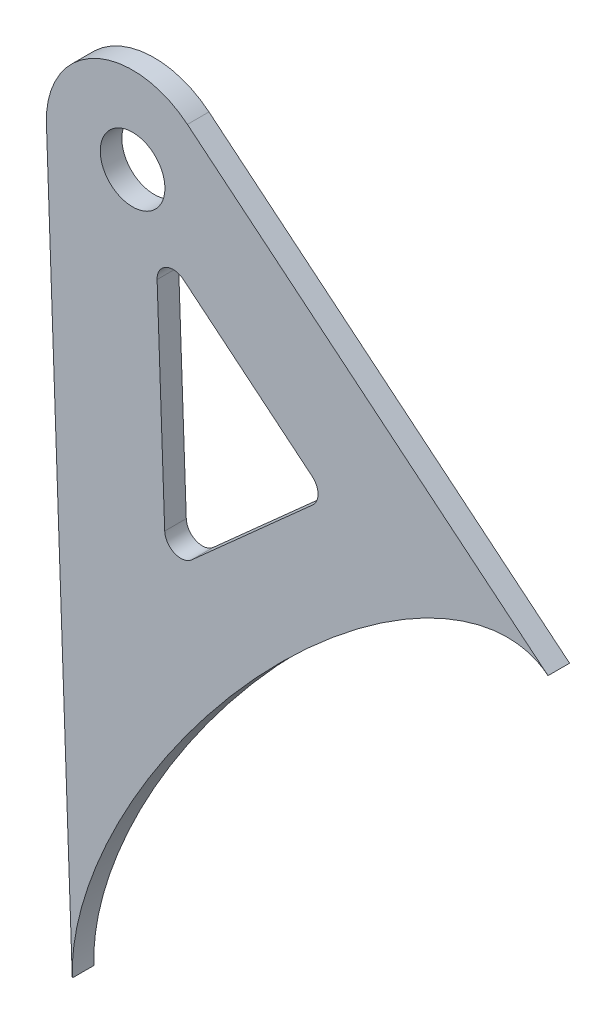
ISO-10303-21;
HEADER;
FILE_DESCRIPTION(('STEP AP214'),'2;1');
FILE_NAME('part.step','',(''),(''),'','','');
FILE_SCHEMA(('AUTOMOTIVE_DESIGN { 1 0 10303 214 1 1 1 1 }'));
ENDSEC;
DATA;
#1=APPLICATION_CONTEXT('core data for automotive mechanical design processes');
#2=APPLICATION_PROTOCOL_DEFINITION('international standard','automotive_design',2000,#1);
#3=PRODUCT_CONTEXT('',#1,'mechanical');
#4=PRODUCT('Part','Part','',(#3));
#5=PRODUCT_RELATED_PRODUCT_CATEGORY('part','',(#4));
#6=PRODUCT_DEFINITION_FORMATION('','',#4);
#7=PRODUCT_DEFINITION_CONTEXT('part definition',#1,'design');
#8=PRODUCT_DEFINITION('design','',#6,#7);
#9=PRODUCT_DEFINITION_SHAPE('','',#8);
#10=(LENGTH_UNIT() NAMED_UNIT(*) SI_UNIT(.MILLI.,.METRE.));
#11=(NAMED_UNIT(*) PLANE_ANGLE_UNIT() SI_UNIT($,.RADIAN.));
#12=(NAMED_UNIT(*) SI_UNIT($,.STERADIAN.) SOLID_ANGLE_UNIT());
#13=UNCERTAINTY_MEASURE_WITH_UNIT(LENGTH_MEASURE(1.E-05),#10,'distance_accuracy_value','');
#14=(GEOMETRIC_REPRESENTATION_CONTEXT(3) GLOBAL_UNCERTAINTY_ASSIGNED_CONTEXT((#13)) GLOBAL_UNIT_ASSIGNED_CONTEXT((#10,
#11,#12)) REPRESENTATION_CONTEXT('',''));
#15=CARTESIAN_POINT('',(0.,0.,0.));
#16=DIRECTION('',(0.,0.,1.));
#17=DIRECTION('',(1.,0.,0.));
#18=AXIS2_PLACEMENT_3D('',#15,#16,#17);
#19=CARTESIAN_POINT('',(1375.39150654888,-231.129570023266,-434.28));
#20=DIRECTION('',(0.,0.,-1.));
#21=DIRECTION('',(0.,-1.,0.));
#22=AXIS2_PLACEMENT_3D('',#19,#20,#21);
#23=PLANE('',#22);
#24=DIRECTION('',(0.035527138054527,-0.999368711968538,0.));
#25=VECTOR('',#24,1.);
#26=CARTESIAN_POINT('',(1352.00505030431,-200.284217104434,-434.28));
#27=LINE('',#26,#25);
#28=CARTESIAN_POINT('',(1352.00505030431,-200.284217104434,-434.28));
#29=VERTEX_POINT('',#28);
#30=CARTESIAN_POINT('',(1354.40386942977,-267.762345400856,-434.28));
#31=VERTEX_POINT('',#30);
#32=EDGE_CURVE('E193',#29,#31,#27,.T.);
#33=ORIENTED_EDGE('',*,*,#32,.F.);
#34=CARTESIAN_POINT('',(1360.,-200.,-434.28));
#35=DIRECTION('',(0.,0.,1.));
#36=DIRECTION('',(1.,0.,0.));
#37=AXIS2_PLACEMENT_3D('',#34,#35,#36);
#38=CIRCLE('',#37,7.99999999993676);
#39=CARTESIAN_POINT('',(1365.08691241126,-193.825591354697,-434.28));
#40=VERTEX_POINT('',#39);
#41=EDGE_CURVE('E169',#40,#29,#38,.T.);
#42=ORIENTED_EDGE('',*,*,#41,.F.);
#43=DIRECTION('',(0.771801080668979,-0.635864051412089,0.));
#44=VECTOR('',#43,1.);
#45=CARTESIAN_POINT('',(1365.08691241126,-193.825591354697,-434.28));
#46=LINE('',#45,#44);
#47=CARTESIAN_POINT('',(1398.54852053125,-221.393619229834,-434.28));
#48=VERTEX_POINT('',#47);
#49=EDGE_CURVE('E174',#40,#48,#46,.T.);
#50=ORIENTED_EDGE('',*,*,#49,.T.);
#51=CARTESIAN_POINT('',(1354.40386942977,-267.762345400856,-434.28));
#52=CARTESIAN_POINT('',(1353.43245275836,-240.436659155121,-434.28));
#53=CARTESIAN_POINT('',(1386.53706756762,-211.615049683143,-434.28));
#54=CARTESIAN_POINT('',(1398.52725809821,-221.376205911584,-434.28));
#55=CARTESIAN_POINT('',(1398.53435990197,-221.381987455749,-434.28));
#56=CARTESIAN_POINT('',(1398.54144739585,-221.387791883071,-434.28));
#57=CARTESIAN_POINT('',(1398.54852053125,-221.393619229834,-434.28));
#58=(BOUNDED_CURVE() B_SPLINE_CURVE(3,(#51,#52,#53,#54,#55,#56,#57),.UNSPECIFIED.,.F.,
.F.) B_SPLINE_CURVE_WITH_KNOTS((4,3,4),(0.0852875382307011,0.5,0.500549054517509),
.UNSPECIFIED.) CURVE() GEOMETRIC_REPRESENTATION_ITEM() RATIONAL_B_SPLINE_CURVE((0.717041560496822,
0.352730571139875,0.447050050974268,1.,0.999267927309988,0.998536658515611,0.99780619361687)) REPRESENTATION_ITEM(''));
#59=EDGE_CURVE('E201',#31,#48,#58,.T.);
#60=ORIENTED_EDGE('',*,*,#59,.F.);
#61=EDGE_LOOP('',(#33,#42,#50,#60));
#62=FACE_BOUND('',#61,.T.);
#63=CARTESIAN_POINT('',(1364.47997732206,-227.50430289175,-434.28));
#64=DIRECTION('',(0.,0.,1.));
#65=DIRECTION('',(1.,0.,0.));
#66=AXIS2_PLACEMENT_3D('',#63,#64,#65);
#67=CIRCLE('',#66,1.49999999999995);
#68=CARTESIAN_POINT('',(1365.47901822837,-228.623193980065,-434.28));
#69=VERTEX_POINT('',#68);
#70=CARTESIAN_POINT('',(1362.9809242541,-227.557593598832,-434.28));
#71=VERTEX_POINT('',#70);
#72=EDGE_CURVE('E119',#69,#71,#67,.F.);
#73=ORIENTED_EDGE('',*,*,#72,.F.);
#74=DIRECTION('',(-0.745927392210289,-0.666027270875869,0.));
#75=VECTOR('',#74,1.);
#76=CARTESIAN_POINT('',(719.297841581458,-805.588579710492,-434.28));
#77=LINE('',#76,#75);
#78=CARTESIAN_POINT('',(1376.70865342178,-218.596422797098,-434.28));
#79=VERTEX_POINT('',#78);
#80=EDGE_CURVE('E128',#79,#69,#77,.T.);
#81=ORIENTED_EDGE('',*,*,#80,.F.);
#82=CARTESIAN_POINT('',(1375.70961251547,-217.477531708782,-434.28));
#83=DIRECTION('',(0.,0.,1.));
#84=DIRECTION('',(1.,0.,0.));
#85=AXIS2_PLACEMENT_3D('',#82,#83,#84);
#86=CIRCLE('',#85,1.50000000000003);
#87=CARTESIAN_POINT('',(1376.66340859259,-216.319830087778,-434.28));
#88=VERTEX_POINT('',#87);
#89=EDGE_CURVE('E133',#79,#88,#86,.T.);
#90=ORIENTED_EDGE('',*,*,#89,.T.);
#91=DIRECTION('',(0.771801080668963,-0.635864051412109,0.));
#92=VECTOR('',#91,1.);
#93=CARTESIAN_POINT('',(450.455564443834,546.755380586496,-434.28));
#94=LINE('',#93,#92);
#95=CARTESIAN_POINT('',(1364.72775142934,-206.486395657352,-434.28));
#96=VERTEX_POINT('',#95);
#97=EDGE_CURVE('E155',#96,#88,#94,.T.);
#98=ORIENTED_EDGE('',*,*,#97,.F.);
#99=CARTESIAN_POINT('',(1363.77395535222,-207.644097278355,-434.28));
#100=DIRECTION('',(0.,0.,1.));
#101=DIRECTION('',(1.,0.,0.));
#102=AXIS2_PLACEMENT_3D('',#99,#100,#101);
#103=CIRCLE('',#102,1.50000000000002);
#104=CARTESIAN_POINT('',(1362.27490228427,-207.697387985437,-434.28));
#105=VERTEX_POINT('',#104);
#106=EDGE_CURVE('E158',#96,#105,#103,.T.);
#107=ORIENTED_EDGE('',*,*,#106,.T.);
#108=DIRECTION('',(0.0355271380545357,-0.999368711968538,0.));
#109=VECTOR('',#108,1.);
#110=CARTESIAN_POINT('',(1353.18123393235,48.1050246370281,-434.28));
#111=LINE('',#110,#109);
#112=EDGE_CURVE('E138',#105,#71,#111,.T.);
#113=ORIENTED_EDGE('',*,*,#112,.T.);
#114=EDGE_LOOP('',(#73,#81,#90,#98,#107,#113));
#115=FACE_BOUND('',#114,.T.);
#116=CARTESIAN_POINT('',(1360.,-200.,-434.28));
#117=DIRECTION('',(0.,0.,1.));
#118=DIRECTION('',(1.,0.,0.));
#119=AXIS2_PLACEMENT_3D('',#116,#117,#118);
#120=CIRCLE('',#119,2.99999999999993);
#121=CARTESIAN_POINT('',(1363.,-200.,-434.28));
#122=VERTEX_POINT('',#121);
#123=EDGE_CURVE('E267',#122,#122,#120,.T.);
#124=ORIENTED_EDGE('',*,*,#123,.T.);
#125=EDGE_LOOP('',(#124));
#126=FACE_BOUND('',#125,.T.);
#127=ADVANCED_FACE('F40',(#62,#115,#126),#23,.T.);
#128=CARTESIAN_POINT('',(1375.39150654888,-231.129570023266,-432.28));
#129=DIRECTION('',(0.,0.,-1.));
#130=DIRECTION('',(0.,-1.,0.));
#131=AXIS2_PLACEMENT_3D('',#128,#129,#130);
#132=PLANE('',#131);
#133=DIRECTION('',(0.0355271380545357,-0.999368711968538,0.));
#134=VECTOR('',#133,1.);
#135=CARTESIAN_POINT('',(1353.18123393235,48.1050246370281,-432.28));
#136=LINE('',#135,#134);
#137=CARTESIAN_POINT('',(1362.27490228427,-207.697387985437,-432.28));
#138=VERTEX_POINT('',#137);
#139=CARTESIAN_POINT('',(1362.9809242541,-227.557593598832,-432.28));
#140=VERTEX_POINT('',#139);
#141=EDGE_CURVE('E139',#138,#140,#136,.T.);
#142=ORIENTED_EDGE('',*,*,#141,.F.);
#143=CARTESIAN_POINT('',(1363.77395535222,-207.644097278355,-432.28));
#144=DIRECTION('',(0.,0.,1.));
#145=DIRECTION('',(1.,0.,0.));
#146=AXIS2_PLACEMENT_3D('',#143,#144,#145);
#147=CIRCLE('',#146,1.50000000000002);
#148=CARTESIAN_POINT('',(1364.72775142934,-206.486395657352,-432.28));
#149=VERTEX_POINT('',#148);
#150=EDGE_CURVE('E142',#149,#138,#147,.T.);
#151=ORIENTED_EDGE('',*,*,#150,.F.);
#152=DIRECTION('',(0.771801080668963,-0.635864051412109,0.));
#153=VECTOR('',#152,1.);
#154=CARTESIAN_POINT('',(450.455564443834,546.755380586496,-432.28));
#155=LINE('',#154,#153);
#156=CARTESIAN_POINT('',(1376.66340859259,-216.319830087778,-432.28));
#157=VERTEX_POINT('',#156);
#158=EDGE_CURVE('E276',#149,#157,#155,.T.);
#159=ORIENTED_EDGE('',*,*,#158,.T.);
#160=CARTESIAN_POINT('',(1375.70961251547,-217.477531708782,-432.28));
#161=DIRECTION('',(0.,0.,1.));
#162=DIRECTION('',(1.,0.,0.));
#163=AXIS2_PLACEMENT_3D('',#160,#161,#162);
#164=CIRCLE('',#163,1.50000000000003);
#165=CARTESIAN_POINT('',(1376.70865342178,-218.596422797098,-432.28));
#166=VERTEX_POINT('',#165);
#167=EDGE_CURVE('E273',#166,#157,#164,.T.);
#168=ORIENTED_EDGE('',*,*,#167,.F.);
#169=DIRECTION('',(-0.745927392210289,-0.666027270875869,0.));
#170=VECTOR('',#169,1.);
#171=CARTESIAN_POINT('',(719.297841581458,-805.588579710492,-432.28));
#172=LINE('',#171,#170);
#173=CARTESIAN_POINT('',(1365.47901822837,-228.623193980065,-432.28));
#174=VERTEX_POINT('',#173);
#175=EDGE_CURVE('E270',#166,#174,#172,.T.);
#176=ORIENTED_EDGE('',*,*,#175,.T.);
#177=CARTESIAN_POINT('',(1364.47997732206,-227.50430289175,-432.28));
#178=DIRECTION('',(0.,0.,1.));
#179=DIRECTION('',(1.,0.,0.));
#180=AXIS2_PLACEMENT_3D('',#177,#178,#179);
#181=CIRCLE('',#180,1.49999999999995);
#182=EDGE_CURVE('E120',#174,#140,#181,.F.);
#183=ORIENTED_EDGE('',*,*,#182,.T.);
#184=EDGE_LOOP('',(#142,#151,#159,#168,#176,#183));
#185=FACE_BOUND('',#184,.T.);
#186=DIRECTION('',(0.035527138054527,-0.999368711968538,0.));
#187=VECTOR('',#186,1.);
#188=CARTESIAN_POINT('',(1352.00505030431,-200.284217104434,-432.28));
#189=LINE('',#188,#187);
#190=CARTESIAN_POINT('',(1352.00505030431,-200.284217104434,-432.28));
#191=VERTEX_POINT('',#190);
#192=CARTESIAN_POINT('',(1354.40386942977,-267.762345400856,-432.28));
#193=VERTEX_POINT('',#192);
#194=EDGE_CURVE('E124',#191,#193,#189,.T.);
#195=ORIENTED_EDGE('',*,*,#194,.T.);
#196=CARTESIAN_POINT('',(1354.40386942977,-267.762345400856,-432.28));
#197=CARTESIAN_POINT('',(1353.43245275836,-240.436659155121,-432.28));
#198=CARTESIAN_POINT('',(1386.53706756762,-211.615049683143,-432.28));
#199=CARTESIAN_POINT('',(1398.52725809821,-221.376205911584,-432.28));
#200=CARTESIAN_POINT('',(1398.53435990197,-221.381987455749,-432.28));
#201=CARTESIAN_POINT('',(1398.54144739585,-221.387791883071,-432.28));
#202=CARTESIAN_POINT('',(1398.54852053125,-221.393619229834,-432.28));
#203=(BOUNDED_CURVE() B_SPLINE_CURVE(3,(#196,#197,#198,#199,#200,#201,#202),.UNSPECIFIED.,.F.,
.F.) B_SPLINE_CURVE_WITH_KNOTS((4,3,4),(0.0852875382307011,0.5,0.500549054517509),
.UNSPECIFIED.) CURVE() GEOMETRIC_REPRESENTATION_ITEM() RATIONAL_B_SPLINE_CURVE((0.717041560496822,
0.352730571139875,0.447050050974268,1.,0.999267927309988,0.998536658515611,0.99780619361687)) REPRESENTATION_ITEM(''));
#204=CARTESIAN_POINT('',(1398.54852053125,-221.393619229834,-432.28));
#205=VERTEX_POINT('',#204);
#206=EDGE_CURVE('E179',#193,#205,#203,.T.);
#207=ORIENTED_EDGE('',*,*,#206,.T.);
#208=DIRECTION('',(0.771801080668979,-0.635864051412089,0.));
#209=VECTOR('',#208,1.);
#210=CARTESIAN_POINT('',(1365.08691241126,-193.825591354697,-432.28));
#211=LINE('',#210,#209);
#212=CARTESIAN_POINT('',(1365.08691241126,-193.825591354697,-432.28));
#213=VERTEX_POINT('',#212);
#214=EDGE_CURVE('E184',#213,#205,#211,.T.);
#215=ORIENTED_EDGE('',*,*,#214,.F.);
#216=CARTESIAN_POINT('',(1360.,-200.,-432.28));
#217=DIRECTION('',(0.,0.,1.));
#218=DIRECTION('',(1.,0.,0.));
#219=AXIS2_PLACEMENT_3D('',#216,#217,#218);
#220=CIRCLE('',#219,7.99999999993676);
#221=EDGE_CURVE('E190',#213,#191,#220,.T.);
#222=ORIENTED_EDGE('',*,*,#221,.T.);
#223=EDGE_LOOP('',(#195,#207,#215,#222));
#224=FACE_BOUND('',#223,.T.);
#225=CARTESIAN_POINT('',(1360.,-200.,-432.28));
#226=DIRECTION('',(0.,0.,1.));
#227=DIRECTION('',(1.,0.,0.));
#228=AXIS2_PLACEMENT_3D('',#225,#226,#227);
#229=CIRCLE('',#228,2.99999999999993);
#230=CARTESIAN_POINT('',(1363.,-200.,-432.28));
#231=VERTEX_POINT('',#230);
#232=EDGE_CURVE('E145',#231,#231,#229,.T.);
#233=ORIENTED_EDGE('',*,*,#232,.F.);
#234=EDGE_LOOP('',(#233));
#235=FACE_BOUND('',#234,.T.);
#236=ADVANCED_FACE('F209',(#185,#224,#235),#132,.F.);
#237=CARTESIAN_POINT('',(1352.00505030431,-200.284217104434,-434.28));
#238=DIRECTION('',(0.999368711968538,0.035527138054527,0.));
#239=DIRECTION('',(-0.035527138054527,0.999368711968538,0.));
#240=AXIS2_PLACEMENT_3D('',#237,#238,#239);
#241=PLANE('',#240);
#242=ORIENTED_EDGE('',*,*,#194,.F.);
#243=DIRECTION('',(0.,0.,1.));
#244=VECTOR('',#243,1.);
#245=CARTESIAN_POINT('',(1352.00505030431,-200.284217104434,-434.28));
#246=LINE('',#245,#244);
#247=EDGE_CURVE('E173',#29,#191,#246,.T.);
#248=ORIENTED_EDGE('',*,*,#247,.F.);
#249=ORIENTED_EDGE('',*,*,#32,.T.);
#250=DIRECTION('',(0.,0.,1.));
#251=VECTOR('',#250,1.);
#252=CARTESIAN_POINT('',(1354.40386942977,-267.762345400856,-434.28));
#253=LINE('',#252,#251);
#254=EDGE_CURVE('E12',#31,#193,#253,.T.);
#255=ORIENTED_EDGE('',*,*,#254,.T.);
#256=EDGE_LOOP('',(#242,#248,#249,#255));
#257=FACE_BOUND('',#256,.T.);
#258=ADVANCED_FACE('F42',(#257),#241,.F.);
#259=DIRECTION('',(0.,0.,1.));
#260=VECTOR('',#259,1.);
#261=SURFACE_OF_LINEAR_EXTRUSION('',#58,#260);
#262=ORIENTED_EDGE('',*,*,#206,.F.);
#263=ORIENTED_EDGE('',*,*,#254,.F.);
#264=ORIENTED_EDGE('',*,*,#59,.T.);
#265=DIRECTION('',(0.,0.,1.));
#266=VECTOR('',#265,1.);
#267=CARTESIAN_POINT('',(1398.54852053125,-221.393619229834,-434.28));
#268=LINE('',#267,#266);
#269=EDGE_CURVE('E48',#48,#205,#268,.T.);
#270=ORIENTED_EDGE('',*,*,#269,.T.);
#271=EDGE_LOOP('',(#262,#263,#264,#270));
#272=FACE_BOUND('',#271,.T.);
#273=ADVANCED_FACE('F199',(#272),#261,.T.);
#274=CARTESIAN_POINT('',(1365.08691241126,-193.825591354697,-434.28));
#275=DIRECTION('',(0.635864051412089,0.771801080668979,0.));
#276=DIRECTION('',(-0.771801080668979,0.635864051412089,0.));
#277=AXIS2_PLACEMENT_3D('',#274,#275,#276);
#278=PLANE('',#277);
#279=ORIENTED_EDGE('',*,*,#214,.T.);
#280=ORIENTED_EDGE('',*,*,#269,.F.);
#281=ORIENTED_EDGE('',*,*,#49,.F.);
#282=DIRECTION('',(0.,0.,1.));
#283=VECTOR('',#282,1.);
#284=CARTESIAN_POINT('',(1365.08691241126,-193.825591354697,-434.28));
#285=LINE('',#284,#283);
#286=EDGE_CURVE('E195',#40,#213,#285,.T.);
#287=ORIENTED_EDGE('',*,*,#286,.T.);
#288=EDGE_LOOP('',(#279,#280,#281,#287));
#289=FACE_BOUND('',#288,.T.);
#290=ADVANCED_FACE('F206',(#289),#278,.T.);
#291=CARTESIAN_POINT('',(1360.,-200.,-434.28));
#292=DIRECTION('',(0.,0.,1.));
#293=DIRECTION('',(-1.,0.,0.));
#294=AXIS2_PLACEMENT_3D('',#291,#292,#293);
#295=CYLINDRICAL_SURFACE('',#294,7.99999999993676);
#296=ORIENTED_EDGE('',*,*,#221,.F.);
#297=ORIENTED_EDGE('',*,*,#286,.F.);
#298=ORIENTED_EDGE('',*,*,#41,.T.);
#299=ORIENTED_EDGE('',*,*,#247,.T.);
#300=EDGE_LOOP('',(#296,#297,#298,#299));
#301=FACE_BOUND('',#300,.T.);
#302=ADVANCED_FACE('F231',(#301),#295,.T.);
#303=CARTESIAN_POINT('',(1364.47997732206,-227.50430289175,-434.28));
#304=DIRECTION('',(0.,0.,1.));
#305=DIRECTION('',(-1.,0.,0.));
#306=AXIS2_PLACEMENT_3D('',#303,#304,#305);
#307=CYLINDRICAL_SURFACE('',#306,1.49999999999995);
#308=ORIENTED_EDGE('',*,*,#182,.F.);
#309=DIRECTION('',(0.,0.,1.));
#310=VECTOR('',#309,1.);
#311=CARTESIAN_POINT('',(1365.47901822837,-228.623193980065,-434.28));
#312=LINE('',#311,#310);
#313=EDGE_CURVE('E115',#69,#174,#312,.T.);
#314=ORIENTED_EDGE('',*,*,#313,.F.);
#315=ORIENTED_EDGE('',*,*,#72,.T.);
#316=DIRECTION('',(0.,0.,1.));
#317=VECTOR('',#316,1.);
#318=CARTESIAN_POINT('',(1362.9809242541,-227.557593598832,-434.28));
#319=LINE('',#318,#317);
#320=EDGE_CURVE('E63',#71,#140,#319,.T.);
#321=ORIENTED_EDGE('',*,*,#320,.T.);
#322=EDGE_LOOP('',(#308,#314,#315,#321));
#323=FACE_BOUND('',#322,.T.);
#324=ADVANCED_FACE('F117',(#323),#307,.F.);
#325=CARTESIAN_POINT('',(719.297841581458,-805.588579710492,-434.28));
#326=DIRECTION('',(0.666027270875869,-0.745927392210289,0.));
#327=DIRECTION('',(0.745927392210289,0.666027270875869,0.));
#328=AXIS2_PLACEMENT_3D('',#325,#326,#327);
#329=PLANE('',#328);
#330=ORIENTED_EDGE('',*,*,#175,.F.);
#331=DIRECTION('',(0.,0.,1.));
#332=VECTOR('',#331,1.);
#333=CARTESIAN_POINT('',(1376.70865342178,-218.596422797098,-434.28));
#334=LINE('',#333,#332);
#335=EDGE_CURVE('E125',#79,#166,#334,.T.);
#336=ORIENTED_EDGE('',*,*,#335,.F.);
#337=ORIENTED_EDGE('',*,*,#80,.T.);
#338=ORIENTED_EDGE('',*,*,#313,.T.);
#339=EDGE_LOOP('',(#330,#336,#337,#338));
#340=FACE_BOUND('',#339,.T.);
#341=ADVANCED_FACE('F129',(#340),#329,.F.);
#342=CARTESIAN_POINT('',(1375.70961251547,-217.477531708782,-434.28));
#343=DIRECTION('',(0.,0.,1.));
#344=DIRECTION('',(-1.,0.,0.));
#345=AXIS2_PLACEMENT_3D('',#342,#343,#344);
#346=CYLINDRICAL_SURFACE('',#345,1.50000000000003);
#347=ORIENTED_EDGE('',*,*,#167,.T.);
#348=DIRECTION('',(0.,0.,1.));
#349=VECTOR('',#348,1.);
#350=CARTESIAN_POINT('',(1376.66340859259,-216.319830087778,-434.28));
#351=LINE('',#350,#349);
#352=EDGE_CURVE('E286',#88,#157,#351,.T.);
#353=ORIENTED_EDGE('',*,*,#352,.F.);
#354=ORIENTED_EDGE('',*,*,#89,.F.);
#355=ORIENTED_EDGE('',*,*,#335,.T.);
#356=EDGE_LOOP('',(#347,#353,#354,#355));
#357=FACE_BOUND('',#356,.T.);
#358=ADVANCED_FACE('F244',(#357),#346,.F.);
#359=CARTESIAN_POINT('',(450.455564443834,546.755380586496,-434.28));
#360=DIRECTION('',(0.635864051412109,0.771801080668963,0.));
#361=DIRECTION('',(-0.771801080668963,0.635864051412109,0.));
#362=AXIS2_PLACEMENT_3D('',#359,#360,#361);
#363=PLANE('',#362);
#364=ORIENTED_EDGE('',*,*,#158,.F.);
#365=DIRECTION('',(0.,0.,1.));
#366=VECTOR('',#365,1.);
#367=CARTESIAN_POINT('',(1364.72775142934,-206.486395657352,-434.28));
#368=LINE('',#367,#366);
#369=EDGE_CURVE('E284',#96,#149,#368,.T.);
#370=ORIENTED_EDGE('',*,*,#369,.F.);
#371=ORIENTED_EDGE('',*,*,#97,.T.);
#372=ORIENTED_EDGE('',*,*,#352,.T.);
#373=EDGE_LOOP('',(#364,#370,#371,#372));
#374=FACE_BOUND('',#373,.T.);
#375=ADVANCED_FACE('F247',(#374),#363,.F.);
#376=CARTESIAN_POINT('',(1363.77395535222,-207.644097278355,-434.28));
#377=DIRECTION('',(0.,0.,1.));
#378=DIRECTION('',(-1.,0.,0.));
#379=AXIS2_PLACEMENT_3D('',#376,#377,#378);
#380=CYLINDRICAL_SURFACE('',#379,1.50000000000002);
#381=ORIENTED_EDGE('',*,*,#150,.T.);
#382=DIRECTION('',(0.,0.,1.));
#383=VECTOR('',#382,1.);
#384=CARTESIAN_POINT('',(1362.27490228427,-207.697387985437,-434.28));
#385=LINE('',#384,#383);
#386=EDGE_CURVE('E55',#105,#138,#385,.T.);
#387=ORIENTED_EDGE('',*,*,#386,.F.);
#388=ORIENTED_EDGE('',*,*,#106,.F.);
#389=ORIENTED_EDGE('',*,*,#369,.T.);
#390=EDGE_LOOP('',(#381,#387,#388,#389));
#391=FACE_BOUND('',#390,.T.);
#392=ADVANCED_FACE('F251',(#391),#380,.F.);
#393=CARTESIAN_POINT('',(1353.18123393235,48.1050246370281,-434.28));
#394=DIRECTION('',(0.999368711968538,0.0355271380545357,0.));
#395=DIRECTION('',(-0.0355271380545357,0.999368711968538,0.));
#396=AXIS2_PLACEMENT_3D('',#393,#394,#395);
#397=PLANE('',#396);
#398=ORIENTED_EDGE('',*,*,#141,.T.);
#399=ORIENTED_EDGE('',*,*,#320,.F.);
#400=ORIENTED_EDGE('',*,*,#112,.F.);
#401=ORIENTED_EDGE('',*,*,#386,.T.);
#402=EDGE_LOOP('',(#398,#399,#400,#401));
#403=FACE_BOUND('',#402,.T.);
#404=ADVANCED_FACE('F255',(#403),#397,.T.);
#405=CARTESIAN_POINT('',(1360.,-200.,-434.28));
#406=DIRECTION('',(0.,0.,1.));
#407=DIRECTION('',(-1.,0.,0.));
#408=AXIS2_PLACEMENT_3D('',#405,#406,#407);
#409=CYLINDRICAL_SURFACE('',#408,2.99999999999993);
#410=ORIENTED_EDGE('',*,*,#123,.F.);
#411=EDGE_LOOP('',(#410));
#412=FACE_BOUND('',#411,.T.);
#413=ORIENTED_EDGE('',*,*,#232,.T.);
#414=EDGE_LOOP('',(#413));
#415=FACE_BOUND('',#414,.T.);
#416=ADVANCED_FACE('F258',(#412,#415),#409,.F.);
#417=CLOSED_SHELL('',(#127,#236,#258,#273,#290,#302,#324,#341,#358,#375,#392,#404,#416));
#418=MANIFOLD_SOLID_BREP('B2',#417);
#419=ADVANCED_BREP_SHAPE_REPRESENTATION('',(#18,#418),#14);
#420=SHAPE_DEFINITION_REPRESENTATION(#9,#419);
ENDSEC;
END-ISO-10303-21;
